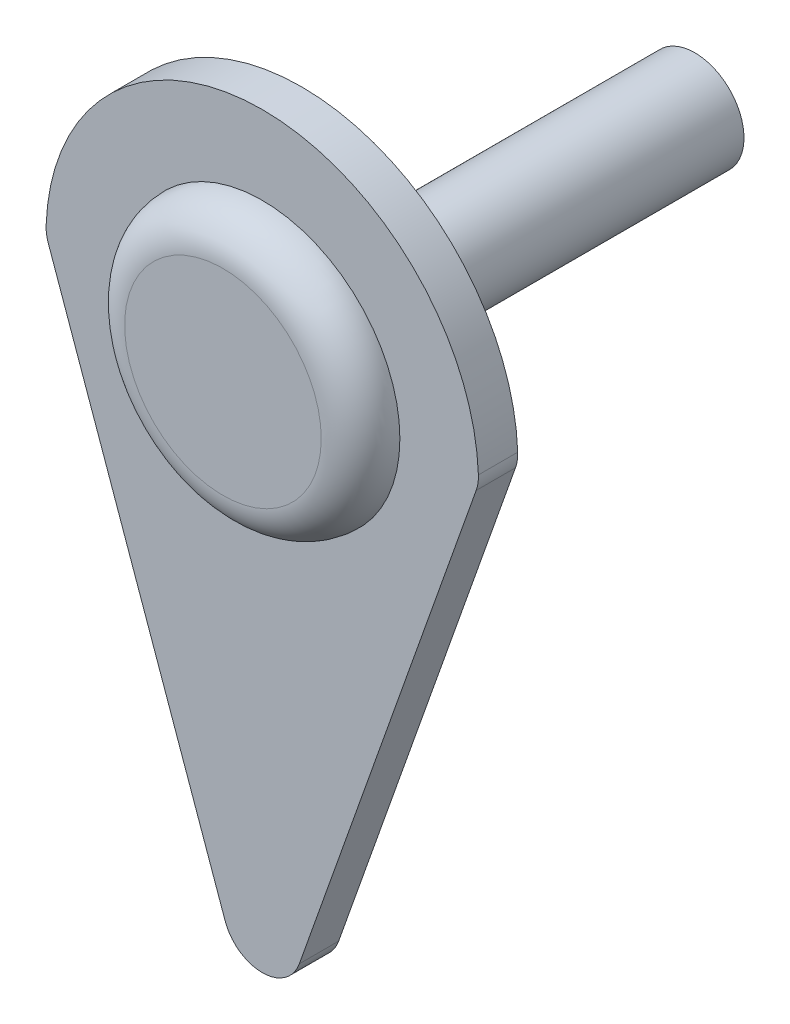
ISO-10303-21;
HEADER;
FILE_DESCRIPTION(('STEP AP214'),'2;1');
FILE_NAME('part.step','',(''),(''),'','','');
FILE_SCHEMA(('AUTOMOTIVE_DESIGN { 1 0 10303 214 1 1 1 1 }'));
ENDSEC;
DATA;
#1=APPLICATION_CONTEXT('core data for automotive mechanical design processes');
#2=APPLICATION_PROTOCOL_DEFINITION('international standard','automotive_design',2000,#1);
#3=PRODUCT_CONTEXT('',#1,'mechanical');
#4=PRODUCT('Part','Part','',(#3));
#5=PRODUCT_RELATED_PRODUCT_CATEGORY('part','',(#4));
#6=PRODUCT_DEFINITION_FORMATION('','',#4);
#7=PRODUCT_DEFINITION_CONTEXT('part definition',#1,'design');
#8=PRODUCT_DEFINITION('design','',#6,#7);
#9=PRODUCT_DEFINITION_SHAPE('','',#8);
#10=(LENGTH_UNIT() NAMED_UNIT(*) SI_UNIT(.MILLI.,.METRE.));
#11=(NAMED_UNIT(*) PLANE_ANGLE_UNIT() SI_UNIT($,.RADIAN.));
#12=(NAMED_UNIT(*) SI_UNIT($,.STERADIAN.) SOLID_ANGLE_UNIT());
#13=UNCERTAINTY_MEASURE_WITH_UNIT(LENGTH_MEASURE(1.E-05),#10,'distance_accuracy_value','');
#14=(GEOMETRIC_REPRESENTATION_CONTEXT(3) GLOBAL_UNCERTAINTY_ASSIGNED_CONTEXT((#13)) GLOBAL_UNIT_ASSIGNED_CONTEXT((#10,
#11,#12)) REPRESENTATION_CONTEXT('',''));
#15=CARTESIAN_POINT('',(0.,0.,0.));
#16=DIRECTION('',(0.,0.,1.));
#17=DIRECTION('',(1.,0.,0.));
#18=AXIS2_PLACEMENT_3D('',#15,#16,#17);
#19=CARTESIAN_POINT('',(4.4970192877116,15.6637605750779,1.));
#20=DIRECTION('',(0.,0.,-1.));
#21=DIRECTION('',(-1.,0.,0.));
#22=AXIS2_PLACEMENT_3D('',#19,#20,#21);
#23=CYLINDRICAL_SURFACE('',#22,0.999999999999999);
#24=CARTESIAN_POINT('',(4.4970192877116,15.6637605750779,0.));
#25=DIRECTION('',(0.,0.,1.));
#26=DIRECTION('',(1.,0.,0.));
#27=AXIS2_PLACEMENT_3D('',#24,#25,#26);
#28=CIRCLE('',#27,0.999999999999999);
#29=CARTESIAN_POINT('',(5.43944703319285,15.3293507299071,0.));
#30=VERTEX_POINT('',#29);
#31=CARTESIAN_POINT('',(5.49635690720307,15.7001518139841,0.));
#32=VERTEX_POINT('',#31);
#33=EDGE_CURVE('E120',#30,#32,#28,.T.);
#34=ORIENTED_EDGE('',*,*,#33,.T.);
#35=DIRECTION('',(0.,0.,-1.));
#36=VECTOR('',#35,1.);
#37=CARTESIAN_POINT('',(5.49635690720307,15.7001518139841,1.));
#38=LINE('',#37,#36);
#39=CARTESIAN_POINT('',(5.49635690720307,15.7001518139841,1.));
#40=VERTEX_POINT('',#39);
#41=EDGE_CURVE('E137',#40,#32,#38,.T.);
#42=ORIENTED_EDGE('',*,*,#41,.F.);
#43=CARTESIAN_POINT('',(4.4970192877116,15.6637605750779,1.));
#44=DIRECTION('',(0.,0.,1.));
#45=DIRECTION('',(1.,0.,0.));
#46=AXIS2_PLACEMENT_3D('',#43,#44,#45);
#47=CIRCLE('',#46,0.999999999999999);
#48=CARTESIAN_POINT('',(5.43944703319285,15.3293507299071,1.));
#49=VERTEX_POINT('',#48);
#50=EDGE_CURVE('E131',#49,#40,#47,.T.);
#51=ORIENTED_EDGE('',*,*,#50,.F.);
#52=DIRECTION('',(0.,0.,-1.));
#53=VECTOR('',#52,1.);
#54=CARTESIAN_POINT('',(5.43944703319285,15.3293507299071,1.));
#55=LINE('',#54,#53);
#56=EDGE_CURVE('E116',#49,#30,#55,.T.);
#57=ORIENTED_EDGE('',*,*,#56,.T.);
#58=EDGE_LOOP('',(#34,#42,#51,#57));
#59=FACE_BOUND('',#58,.T.);
#60=ADVANCED_FACE('F34',(#59),#23,.T.);
#61=CARTESIAN_POINT('',(0.,15.5,1.));
#62=DIRECTION('',(0.,0.,-1.));
#63=DIRECTION('',(-1.,0.,0.));
#64=AXIS2_PLACEMENT_3D('',#61,#62,#63);
#65=CYLINDRICAL_SURFACE('',#64,5.5);
#66=CARTESIAN_POINT('',(0.,15.5,0.));
#67=DIRECTION('',(0.,0.,1.));
#68=DIRECTION('',(1.,0.,0.));
#69=AXIS2_PLACEMENT_3D('',#66,#67,#68);
#70=CIRCLE('',#69,5.5);
#71=CARTESIAN_POINT('',(-5.49635690720307,15.7001518139841,0.));
#72=VERTEX_POINT('',#71);
#73=EDGE_CURVE('E123',#32,#72,#70,.T.);
#74=ORIENTED_EDGE('',*,*,#73,.T.);
#75=DIRECTION('',(0.,0.,-1.));
#76=VECTOR('',#75,1.);
#77=CARTESIAN_POINT('',(-5.49635690720307,15.7001518139841,1.));
#78=LINE('',#77,#76);
#79=CARTESIAN_POINT('',(-5.49635690720307,15.7001518139841,1.));
#80=VERTEX_POINT('',#79);
#81=EDGE_CURVE('E135',#80,#72,#78,.T.);
#82=ORIENTED_EDGE('',*,*,#81,.F.);
#83=CARTESIAN_POINT('',(0.,15.5,1.));
#84=DIRECTION('',(0.,0.,1.));
#85=DIRECTION('',(1.,0.,0.));
#86=AXIS2_PLACEMENT_3D('',#83,#84,#85);
#87=CIRCLE('',#86,5.5);
#88=EDGE_CURVE('E89',#40,#80,#87,.T.);
#89=ORIENTED_EDGE('',*,*,#88,.F.);
#90=ORIENTED_EDGE('',*,*,#41,.T.);
#91=EDGE_LOOP('',(#74,#82,#89,#90));
#92=FACE_BOUND('',#91,.T.);
#93=ADVANCED_FACE('F150',(#92),#65,.T.);
#94=CARTESIAN_POINT('',(-4.4970192877116,15.6637605750779,1.));
#95=DIRECTION('',(0.,0.,-1.));
#96=DIRECTION('',(-1.,0.,0.));
#97=AXIS2_PLACEMENT_3D('',#94,#95,#96);
#98=CYLINDRICAL_SURFACE('',#97,1.);
#99=CARTESIAN_POINT('',(-4.4970192877116,15.6637605750779,0.));
#100=DIRECTION('',(0.,0.,1.));
#101=DIRECTION('',(-1.,0.,0.));
#102=AXIS2_PLACEMENT_3D('',#99,#100,#101);
#103=CIRCLE('',#102,1.);
#104=CARTESIAN_POINT('',(-5.43944703319285,15.3293507299071,0.));
#105=VERTEX_POINT('',#104);
#106=EDGE_CURVE('E126',#72,#105,#103,.T.);
#107=ORIENTED_EDGE('',*,*,#106,.T.);
#108=DIRECTION('',(0.,0.,-1.));
#109=VECTOR('',#108,1.);
#110=CARTESIAN_POINT('',(-5.43944703319285,15.3293507299071,1.));
#111=LINE('',#110,#109);
#112=CARTESIAN_POINT('',(-5.43944703319285,15.3293507299071,1.));
#113=VERTEX_POINT('',#112);
#114=EDGE_CURVE('E111',#113,#105,#111,.T.);
#115=ORIENTED_EDGE('',*,*,#114,.F.);
#116=CARTESIAN_POINT('',(-4.4970192877116,15.6637605750779,1.));
#117=DIRECTION('',(0.,0.,1.));
#118=DIRECTION('',(-1.,0.,0.));
#119=AXIS2_PLACEMENT_3D('',#116,#117,#118);
#120=CIRCLE('',#119,1.);
#121=EDGE_CURVE('E102',#80,#113,#120,.T.);
#122=ORIENTED_EDGE('',*,*,#121,.F.);
#123=ORIENTED_EDGE('',*,*,#81,.T.);
#124=EDGE_LOOP('',(#107,#115,#122,#123));
#125=FACE_BOUND('',#124,.T.);
#126=ADVANCED_FACE('F153',(#125),#98,.T.);
#127=CARTESIAN_POINT('',(-0.942427745481257,2.65593273726536,1.));
#128=DIRECTION('',(0.942427745481246,0.334409845170765,0.));
#129=DIRECTION('',(-0.334409845170765,0.942427745481246,0.));
#130=AXIS2_PLACEMENT_3D('',#127,#128,#129);
#131=PLANE('',#130);
#132=DIRECTION('',(0.334409845170765,-0.942427745481246,0.));
#133=VECTOR('',#132,1.);
#134=CARTESIAN_POINT('',(-0.942427745481257,2.65593273726536,0.));
#135=LINE('',#134,#133);
#136=CARTESIAN_POINT('',(-0.942427745481257,2.65593273726536,0.));
#137=VERTEX_POINT('',#136);
#138=EDGE_CURVE('E110',#105,#137,#135,.T.);
#139=ORIENTED_EDGE('',*,*,#138,.T.);
#140=DIRECTION('',(0.,0.,-1.));
#141=VECTOR('',#140,1.);
#142=CARTESIAN_POINT('',(-0.942427745481257,2.65593273726536,1.));
#143=LINE('',#142,#141);
#144=CARTESIAN_POINT('',(-0.942427745481257,2.65593273726536,1.));
#145=VERTEX_POINT('',#144);
#146=EDGE_CURVE('E107',#145,#137,#143,.T.);
#147=ORIENTED_EDGE('',*,*,#146,.F.);
#148=DIRECTION('',(0.334409845170765,-0.942427745481246,0.));
#149=VECTOR('',#148,1.);
#150=CARTESIAN_POINT('',(-0.942427745481257,2.65593273726536,1.));
#151=LINE('',#150,#149);
#152=EDGE_CURVE('E96',#113,#145,#151,.T.);
#153=ORIENTED_EDGE('',*,*,#152,.F.);
#154=ORIENTED_EDGE('',*,*,#114,.T.);
#155=EDGE_LOOP('',(#139,#147,#153,#154));
#156=FACE_BOUND('',#155,.T.);
#157=ADVANCED_FACE('F108',(#156),#131,.F.);
#158=CARTESIAN_POINT('',(0.,2.9903425824361,1.));
#159=DIRECTION('',(0.,0.,-1.));
#160=DIRECTION('',(-1.,0.,0.));
#161=AXIS2_PLACEMENT_3D('',#158,#159,#160);
#162=CYLINDRICAL_SURFACE('',#161,1.);
#163=CARTESIAN_POINT('',(0.,2.9903425824361,0.));
#164=DIRECTION('',(0.,0.,1.));
#165=DIRECTION('',(-1.,0.,0.));
#166=AXIS2_PLACEMENT_3D('',#163,#164,#165);
#167=CIRCLE('',#166,1.);
#168=CARTESIAN_POINT('',(0.942427745481257,2.65593273726536,0.));
#169=VERTEX_POINT('',#168);
#170=EDGE_CURVE('E74',#137,#169,#167,.T.);
#171=ORIENTED_EDGE('',*,*,#170,.T.);
#172=DIRECTION('',(0.,0.,-1.));
#173=VECTOR('',#172,1.);
#174=CARTESIAN_POINT('',(0.942427745481257,2.65593273726536,1.));
#175=LINE('',#174,#173);
#176=CARTESIAN_POINT('',(0.942427745481257,2.65593273726536,1.));
#177=VERTEX_POINT('',#176);
#178=EDGE_CURVE('E112',#177,#169,#175,.T.);
#179=ORIENTED_EDGE('',*,*,#178,.F.);
#180=CARTESIAN_POINT('',(0.,2.9903425824361,1.));
#181=DIRECTION('',(0.,0.,1.));
#182=DIRECTION('',(-1.,0.,0.));
#183=AXIS2_PLACEMENT_3D('',#180,#181,#182);
#184=CIRCLE('',#183,1.);
#185=EDGE_CURVE('E100',#145,#177,#184,.T.);
#186=ORIENTED_EDGE('',*,*,#185,.F.);
#187=ORIENTED_EDGE('',*,*,#146,.T.);
#188=EDGE_LOOP('',(#171,#179,#186,#187));
#189=FACE_BOUND('',#188,.T.);
#190=ADVANCED_FACE('F114',(#189),#162,.T.);
#191=CARTESIAN_POINT('',(0.942427745481257,2.65593273726536,1.));
#192=DIRECTION('',(-0.942427745481247,0.334409845170765,0.));
#193=DIRECTION('',(-0.334409845170765,-0.942427745481247,0.));
#194=AXIS2_PLACEMENT_3D('',#191,#192,#193);
#195=PLANE('',#194);
#196=DIRECTION('',(0.334409845170765,0.942427745481247,0.));
#197=VECTOR('',#196,1.);
#198=CARTESIAN_POINT('',(0.942427745481257,2.65593273726536,0.));
#199=LINE('',#198,#197);
#200=EDGE_CURVE('E80',#169,#30,#199,.T.);
#201=ORIENTED_EDGE('',*,*,#200,.T.);
#202=ORIENTED_EDGE('',*,*,#56,.F.);
#203=DIRECTION('',(0.334409845170765,0.942427745481247,0.));
#204=VECTOR('',#203,1.);
#205=CARTESIAN_POINT('',(0.942427745481257,2.65593273726536,1.));
#206=LINE('',#205,#204);
#207=EDGE_CURVE('E51',#177,#49,#206,.T.);
#208=ORIENTED_EDGE('',*,*,#207,.F.);
#209=ORIENTED_EDGE('',*,*,#178,.T.);
#210=EDGE_LOOP('',(#201,#202,#208,#209));
#211=FACE_BOUND('',#210,.T.);
#212=ADVANCED_FACE('F158',(#211),#195,.F.);
#213=CARTESIAN_POINT('',(4.4970192877116,15.6637605750779,1.));
#214=DIRECTION('',(0.,0.,1.));
#215=DIRECTION('',(1.,0.,0.));
#216=AXIS2_PLACEMENT_3D('',#213,#214,#215);
#217=PLANE('',#216);
#218=CARTESIAN_POINT('',(0.,15.5,1.));
#219=DIRECTION('',(0.,0.,1.));
#220=DIRECTION('',(1.,0.,0.));
#221=AXIS2_PLACEMENT_3D('',#218,#219,#220);
#222=CIRCLE('',#221,3.5);
#223=CARTESIAN_POINT('',(3.5,15.5,1.));
#224=VERTEX_POINT('',#223);
#225=EDGE_CURVE('E138',#224,#224,#222,.T.);
#226=ORIENTED_EDGE('',*,*,#225,.F.);
#227=EDGE_LOOP('',(#226));
#228=FACE_BOUND('',#227,.T.);
#229=ORIENTED_EDGE('',*,*,#50,.T.);
#230=ORIENTED_EDGE('',*,*,#88,.T.);
#231=ORIENTED_EDGE('',*,*,#121,.T.);
#232=ORIENTED_EDGE('',*,*,#152,.T.);
#233=ORIENTED_EDGE('',*,*,#185,.T.);
#234=ORIENTED_EDGE('',*,*,#207,.T.);
#235=EDGE_LOOP('',(#229,#230,#231,#232,#233,#234));
#236=FACE_BOUND('',#235,.T.);
#237=ADVANCED_FACE('F98',(#228,#236),#217,.T.);
#238=CARTESIAN_POINT('',(4.4970192877116,15.6637605750779,0.));
#239=DIRECTION('',(0.,0.,1.));
#240=DIRECTION('',(1.,0.,0.));
#241=AXIS2_PLACEMENT_3D('',#238,#239,#240);
#242=PLANE('',#241);
#243=CARTESIAN_POINT('',(0.,15.5,0.));
#244=DIRECTION('',(0.,0.,-1.));
#245=DIRECTION('',(-1.,0.,0.));
#246=AXIS2_PLACEMENT_3D('',#243,#244,#245);
#247=CIRCLE('',#246,1.25);
#248=CARTESIAN_POINT('',(-1.25,15.5,0.));
#249=VERTEX_POINT('',#248);
#250=EDGE_CURVE('E43',#249,#249,#247,.T.);
#251=ORIENTED_EDGE('',*,*,#250,.F.);
#252=EDGE_LOOP('',(#251));
#253=FACE_BOUND('',#252,.T.);
#254=ORIENTED_EDGE('',*,*,#33,.F.);
#255=ORIENTED_EDGE('',*,*,#200,.F.);
#256=ORIENTED_EDGE('',*,*,#170,.F.);
#257=ORIENTED_EDGE('',*,*,#138,.F.);
#258=ORIENTED_EDGE('',*,*,#106,.F.);
#259=ORIENTED_EDGE('',*,*,#73,.F.);
#260=EDGE_LOOP('',(#254,#255,#256,#257,#258,#259));
#261=FACE_BOUND('',#260,.T.);
#262=ADVANCED_FACE('F156',(#253,#261),#242,.F.);
#263=CARTESIAN_POINT('',(0.,15.5,2.));
#264=DIRECTION('',(0.,0.,1.));
#265=DIRECTION('',(1.,0.,0.));
#266=AXIS2_PLACEMENT_3D('',#263,#264,#265);
#267=PLANE('',#266);
#268=CARTESIAN_POINT('',(0.,15.5,2.));
#269=DIRECTION('',(0.,0.,1.));
#270=DIRECTION('',(1.,0.,0.));
#271=AXIS2_PLACEMENT_3D('',#268,#269,#270);
#272=CIRCLE('',#271,2.5);
#273=CARTESIAN_POINT('',(2.5,15.5,2.));
#274=VERTEX_POINT('',#273);
#275=EDGE_CURVE('E11',#274,#274,#272,.T.);
#276=ORIENTED_EDGE('',*,*,#275,.T.);
#277=EDGE_LOOP('',(#276));
#278=FACE_BOUND('',#277,.T.);
#279=ADVANCED_FACE('F205',(#278),#267,.T.);
#280=CARTESIAN_POINT('',(0.,15.5,-10.));
#281=DIRECTION('',(0.,0.,1.));
#282=DIRECTION('',(1.,0.,0.));
#283=AXIS2_PLACEMENT_3D('',#280,#281,#282);
#284=CYLINDRICAL_SURFACE('',#283,1.25);
#285=CARTESIAN_POINT('',(0.,15.5,-10.));
#286=DIRECTION('',(0.,0.,-1.));
#287=DIRECTION('',(-1.,0.,0.));
#288=AXIS2_PLACEMENT_3D('',#285,#286,#287);
#289=CIRCLE('',#288,1.25);
#290=CARTESIAN_POINT('',(-1.25,15.5,-10.));
#291=VERTEX_POINT('',#290);
#292=EDGE_CURVE('E124',#291,#291,#289,.T.);
#293=ORIENTED_EDGE('',*,*,#292,.F.);
#294=EDGE_LOOP('',(#293));
#295=FACE_BOUND('',#294,.T.);
#296=ORIENTED_EDGE('',*,*,#250,.T.);
#297=EDGE_LOOP('',(#296));
#298=FACE_BOUND('',#297,.T.);
#299=ADVANCED_FACE('F212',(#295,#298),#284,.T.);
#300=CARTESIAN_POINT('',(0.,15.5,-10.));
#301=DIRECTION('',(0.,0.,-1.));
#302=DIRECTION('',(-1.,0.,0.));
#303=AXIS2_PLACEMENT_3D('',#300,#301,#302);
#304=PLANE('',#303);
#305=ORIENTED_EDGE('',*,*,#292,.T.);
#306=EDGE_LOOP('',(#305));
#307=FACE_BOUND('',#306,.T.);
#308=ADVANCED_FACE('F217',(#307),#304,.T.);
#309=CARTESIAN_POINT('',(0.,15.5,1.));
#310=DIRECTION('',(0.,0.,1.));
#311=DIRECTION('',(1.,0.,0.));
#312=AXIS2_PLACEMENT_3D('',#309,#310,#311);
#313=TOROIDAL_SURFACE('',#312,2.5,1.);
#314=ORIENTED_EDGE('',*,*,#225,.T.);
#315=EDGE_LOOP('',(#314));
#316=FACE_BOUND('',#315,.T.);
#317=ORIENTED_EDGE('',*,*,#275,.F.);
#318=EDGE_LOOP('',(#317));
#319=FACE_BOUND('',#318,.T.);
#320=ADVANCED_FACE('F36',(#316,#319),#313,.T.);
#321=CLOSED_SHELL('',(#60,#93,#126,#157,#190,#212,#237,#262,#279,#299,#308,#320));
#322=MANIFOLD_SOLID_BREP('B2',#321);
#323=ADVANCED_BREP_SHAPE_REPRESENTATION('',(#18,#322),#14);
#324=SHAPE_DEFINITION_REPRESENTATION(#9,#323);
ENDSEC;
END-ISO-10303-21;
